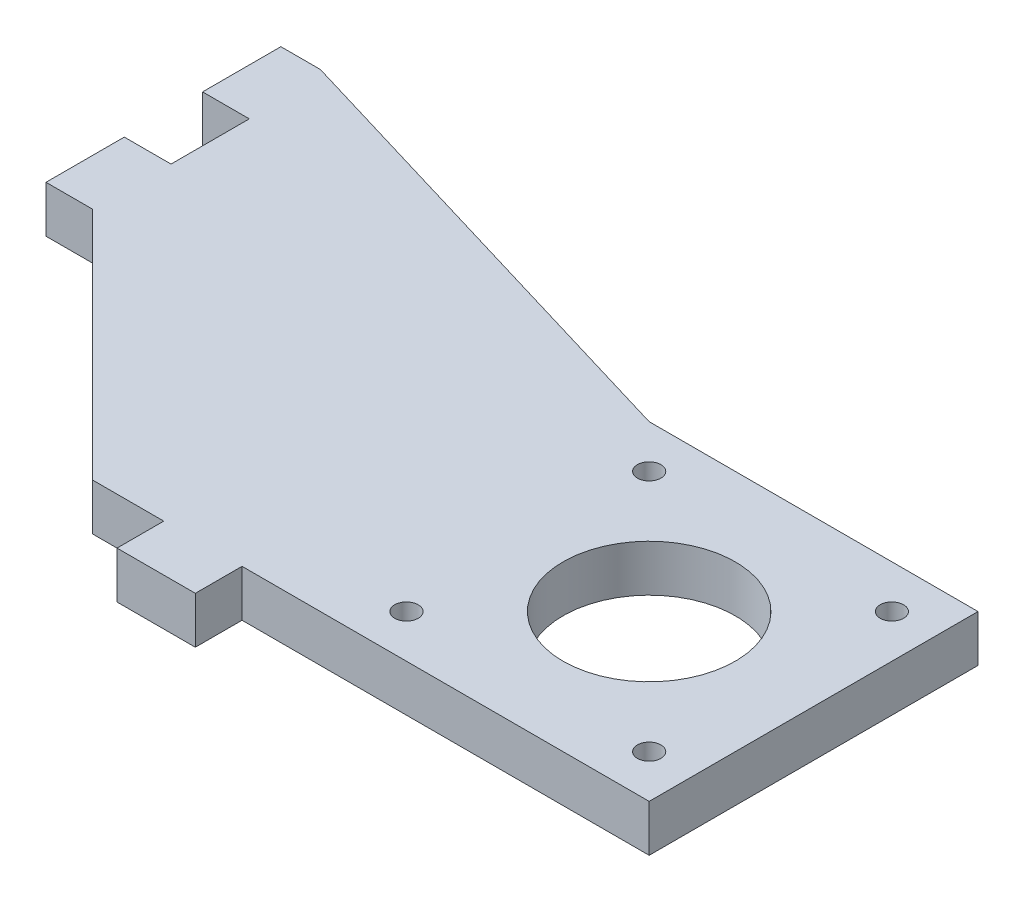
ISO-10303-21;
HEADER;
FILE_DESCRIPTION(('STEP AP214'),'2;1');
FILE_NAME('part.step','',(''),(''),'','','');
FILE_SCHEMA(('AUTOMOTIVE_DESIGN { 1 0 10303 214 1 1 1 1 }'));
ENDSEC;
DATA;
#1=APPLICATION_CONTEXT('core data for automotive mechanical design processes');
#2=APPLICATION_PROTOCOL_DEFINITION('international standard','automotive_design',2000,#1);
#3=PRODUCT_CONTEXT('',#1,'mechanical');
#4=PRODUCT('Part','Part','',(#3));
#5=PRODUCT_RELATED_PRODUCT_CATEGORY('part','',(#4));
#6=PRODUCT_DEFINITION_FORMATION('','',#4);
#7=PRODUCT_DEFINITION_CONTEXT('part definition',#1,'design');
#8=PRODUCT_DEFINITION('design','',#6,#7);
#9=PRODUCT_DEFINITION_SHAPE('','',#8);
#10=(LENGTH_UNIT() NAMED_UNIT(*) SI_UNIT(.MILLI.,.METRE.));
#11=(NAMED_UNIT(*) PLANE_ANGLE_UNIT() SI_UNIT($,.RADIAN.));
#12=(NAMED_UNIT(*) SI_UNIT($,.STERADIAN.) SOLID_ANGLE_UNIT());
#13=UNCERTAINTY_MEASURE_WITH_UNIT(LENGTH_MEASURE(1.E-05),#10,'distance_accuracy_value','');
#14=(GEOMETRIC_REPRESENTATION_CONTEXT(3) GLOBAL_UNCERTAINTY_ASSIGNED_CONTEXT((#13)) GLOBAL_UNIT_ASSIGNED_CONTEXT((#10,
#11,#12)) REPRESENTATION_CONTEXT('',''));
#15=CARTESIAN_POINT('',(0.,0.,0.));
#16=DIRECTION('',(0.,0.,1.));
#17=DIRECTION('',(1.,0.,0.));
#18=AXIS2_PLACEMENT_3D('',#15,#16,#17);
#19=CARTESIAN_POINT('',(29.9590399999999,5.969,29.95904));
#20=DIRECTION('',(0.707106781186549,0.,-0.707106781186546));
#21=DIRECTION('',(-0.707106781186546,0.,-0.707106781186549));
#22=AXIS2_PLACEMENT_3D('',#19,#20,#21);
#23=PLANE('',#22);
#24=DIRECTION('',(0.707106781186546,0.,0.707106781186549));
#25=VECTOR('',#24,1.);
#26=CARTESIAN_POINT('',(29.9590399999999,0.,29.95904));
#27=LINE('',#26,#25);
#28=CARTESIAN_POINT('',(0.,0.,0.));
#29=VERTEX_POINT('',#28);
#30=CARTESIAN_POINT('',(29.9590399999999,0.,29.95904));
#31=VERTEX_POINT('',#30);
#32=EDGE_CURVE('E160',#29,#31,#27,.T.);
#33=ORIENTED_EDGE('',*,*,#32,.T.);
#34=DIRECTION('',(0.,-1.,0.));
#35=VECTOR('',#34,1.);
#36=CARTESIAN_POINT('',(29.9590399999999,5.969,29.95904));
#37=LINE('',#36,#35);
#38=CARTESIAN_POINT('',(29.9590399999999,5.969,29.95904));
#39=VERTEX_POINT('',#38);
#40=EDGE_CURVE('E11',#39,#31,#37,.T.);
#41=ORIENTED_EDGE('',*,*,#40,.F.);
#42=DIRECTION('',(0.707106781186546,0.,0.707106781186549));
#43=VECTOR('',#42,1.);
#44=CARTESIAN_POINT('',(29.9590399999999,5.969,29.95904));
#45=LINE('',#44,#43);
#46=CARTESIAN_POINT('',(0.,5.969,0.));
#47=VERTEX_POINT('',#46);
#48=EDGE_CURVE('E186',#47,#39,#45,.T.);
#49=ORIENTED_EDGE('',*,*,#48,.F.);
#50=DIRECTION('',(0.,-1.,0.));
#51=VECTOR('',#50,1.);
#52=CARTESIAN_POINT('',(0.,5.969,0.));
#53=LINE('',#52,#51);
#54=EDGE_CURVE('E156',#47,#29,#53,.T.);
#55=ORIENTED_EDGE('',*,*,#54,.T.);
#56=EDGE_LOOP('',(#33,#41,#49,#55));
#57=FACE_BOUND('',#56,.T.);
#58=ADVANCED_FACE('F32',(#57),#23,.F.);
#59=CARTESIAN_POINT('',(39.031,5.969,29.95904));
#60=DIRECTION('',(0.,0.,-1.));
#61=DIRECTION('',(-1.,0.,0.));
#62=AXIS2_PLACEMENT_3D('',#59,#60,#61);
#63=PLANE('',#62);
#64=DIRECTION('',(1.,0.,0.));
#65=VECTOR('',#64,1.);
#66=CARTESIAN_POINT('',(39.031,0.,29.95904));
#67=LINE('',#66,#65);
#68=CARTESIAN_POINT('',(39.031,0.,29.95904));
#69=VERTEX_POINT('',#68);
#70=EDGE_CURVE('E163',#31,#69,#67,.T.);
#71=ORIENTED_EDGE('',*,*,#70,.T.);
#72=DIRECTION('',(0.,-1.,0.));
#73=VECTOR('',#72,1.);
#74=CARTESIAN_POINT('',(39.031,5.969,29.95904));
#75=LINE('',#74,#73);
#76=CARTESIAN_POINT('',(39.031,5.969,29.95904));
#77=VERTEX_POINT('',#76);
#78=EDGE_CURVE('E40',#77,#69,#75,.T.);
#79=ORIENTED_EDGE('',*,*,#78,.F.);
#80=DIRECTION('',(1.,0.,0.));
#81=VECTOR('',#80,1.);
#82=CARTESIAN_POINT('',(39.031,5.969,29.95904));
#83=LINE('',#82,#81);
#84=EDGE_CURVE('E104',#39,#77,#83,.T.);
#85=ORIENTED_EDGE('',*,*,#84,.F.);
#86=ORIENTED_EDGE('',*,*,#40,.T.);
#87=EDGE_LOOP('',(#71,#79,#85,#86));
#88=FACE_BOUND('',#87,.T.);
#89=ADVANCED_FACE('F271',(#88),#63,.F.);
#90=CARTESIAN_POINT('',(39.031,5.969,35.92804));
#91=DIRECTION('',(1.,0.,0.));
#92=DIRECTION('',(0.,0.,-1.));
#93=AXIS2_PLACEMENT_3D('',#90,#91,#92);
#94=PLANE('',#93);
#95=DIRECTION('',(0.,0.,1.));
#96=VECTOR('',#95,1.);
#97=CARTESIAN_POINT('',(39.031,0.,35.92804));
#98=LINE('',#97,#96);
#99=CARTESIAN_POINT('',(39.031,0.,35.92804));
#100=VERTEX_POINT('',#99);
#101=EDGE_CURVE('E166',#69,#100,#98,.T.);
#102=ORIENTED_EDGE('',*,*,#101,.T.);
#103=DIRECTION('',(0.,-1.,0.));
#104=VECTOR('',#103,1.);
#105=CARTESIAN_POINT('',(39.031,5.969,35.92804));
#106=LINE('',#105,#104);
#107=CARTESIAN_POINT('',(39.031,5.969,35.92804));
#108=VERTEX_POINT('',#107);
#109=EDGE_CURVE('E208',#108,#100,#106,.T.);
#110=ORIENTED_EDGE('',*,*,#109,.F.);
#111=DIRECTION('',(0.,0.,1.));
#112=VECTOR('',#111,1.);
#113=CARTESIAN_POINT('',(39.031,5.969,35.92804));
#114=LINE('',#113,#112);
#115=EDGE_CURVE('E216',#77,#108,#114,.T.);
#116=ORIENTED_EDGE('',*,*,#115,.F.);
#117=ORIENTED_EDGE('',*,*,#78,.T.);
#118=EDGE_LOOP('',(#102,#110,#116,#117));
#119=FACE_BOUND('',#118,.T.);
#120=ADVANCED_FACE('F214',(#119),#94,.F.);
#121=CARTESIAN_POINT('',(49.031,5.969,35.92804));
#122=DIRECTION('',(0.,0.,-1.));
#123=DIRECTION('',(-1.,0.,0.));
#124=AXIS2_PLACEMENT_3D('',#121,#122,#123);
#125=PLANE('',#124);
#126=DIRECTION('',(1.,0.,0.));
#127=VECTOR('',#126,1.);
#128=CARTESIAN_POINT('',(49.031,0.,35.92804));
#129=LINE('',#128,#127);
#130=CARTESIAN_POINT('',(49.031,0.,35.92804));
#131=VERTEX_POINT('',#130);
#132=EDGE_CURVE('E168',#100,#131,#129,.T.);
#133=ORIENTED_EDGE('',*,*,#132,.T.);
#134=DIRECTION('',(0.,-1.,0.));
#135=VECTOR('',#134,1.);
#136=CARTESIAN_POINT('',(49.031,5.969,35.92804));
#137=LINE('',#136,#135);
#138=CARTESIAN_POINT('',(49.031,5.969,35.92804));
#139=VERTEX_POINT('',#138);
#140=EDGE_CURVE('E205',#139,#131,#137,.T.);
#141=ORIENTED_EDGE('',*,*,#140,.F.);
#142=DIRECTION('',(1.,0.,0.));
#143=VECTOR('',#142,1.);
#144=CARTESIAN_POINT('',(49.031,5.969,35.92804));
#145=LINE('',#144,#143);
#146=EDGE_CURVE('E236',#108,#139,#145,.T.);
#147=ORIENTED_EDGE('',*,*,#146,.F.);
#148=ORIENTED_EDGE('',*,*,#109,.T.);
#149=EDGE_LOOP('',(#133,#141,#147,#148));
#150=FACE_BOUND('',#149,.T.);
#151=ADVANCED_FACE('F226',(#150),#125,.F.);
#152=CARTESIAN_POINT('',(49.031,5.969,29.95904));
#153=DIRECTION('',(-1.,0.,0.));
#154=DIRECTION('',(0.,0.,1.));
#155=AXIS2_PLACEMENT_3D('',#152,#153,#154);
#156=PLANE('',#155);
#157=DIRECTION('',(0.,0.,-1.));
#158=VECTOR('',#157,1.);
#159=CARTESIAN_POINT('',(49.031,0.,29.95904));
#160=LINE('',#159,#158);
#161=CARTESIAN_POINT('',(49.031,0.,29.95904));
#162=VERTEX_POINT('',#161);
#163=EDGE_CURVE('E170',#131,#162,#160,.T.);
#164=ORIENTED_EDGE('',*,*,#163,.T.);
#165=DIRECTION('',(0.,-1.,0.));
#166=VECTOR('',#165,1.);
#167=CARTESIAN_POINT('',(49.031,5.969,29.95904));
#168=LINE('',#167,#166);
#169=CARTESIAN_POINT('',(49.031,5.969,29.95904));
#170=VERTEX_POINT('',#169);
#171=EDGE_CURVE('E202',#170,#162,#168,.T.);
#172=ORIENTED_EDGE('',*,*,#171,.F.);
#173=DIRECTION('',(0.,0.,-1.));
#174=VECTOR('',#173,1.);
#175=CARTESIAN_POINT('',(49.031,5.969,29.95904));
#176=LINE('',#175,#174);
#177=EDGE_CURVE('E232',#139,#170,#176,.T.);
#178=ORIENTED_EDGE('',*,*,#177,.F.);
#179=ORIENTED_EDGE('',*,*,#140,.T.);
#180=EDGE_LOOP('',(#164,#172,#178,#179));
#181=FACE_BOUND('',#180,.T.);
#182=ADVANCED_FACE('F230',(#181),#156,.F.);
#183=CARTESIAN_POINT('',(59.031,5.969,29.95904));
#184=DIRECTION('',(0.,0.,-1.));
#185=DIRECTION('',(-1.,0.,0.));
#186=AXIS2_PLACEMENT_3D('',#183,#184,#185);
#187=PLANE('',#186);
#188=DIRECTION('',(1.,0.,0.));
#189=VECTOR('',#188,1.);
#190=CARTESIAN_POINT('',(59.031,0.,29.95904));
#191=LINE('',#190,#189);
#192=CARTESIAN_POINT('',(101.031,0.,29.95904));
#193=VERTEX_POINT('',#192);
#194=EDGE_CURVE('E172',#162,#193,#191,.T.);
#195=ORIENTED_EDGE('',*,*,#194,.T.);
#196=DIRECTION('',(0.,1.,0.));
#197=VECTOR('',#196,1.);
#198=CARTESIAN_POINT('',(101.031,0.,29.95904));
#199=LINE('',#198,#197);
#200=CARTESIAN_POINT('',(101.031,5.969,29.95904));
#201=VERTEX_POINT('',#200);
#202=EDGE_CURVE('E471',#193,#201,#199,.T.);
#203=ORIENTED_EDGE('',*,*,#202,.T.);
#204=DIRECTION('',(1.,0.,0.));
#205=VECTOR('',#204,1.);
#206=CARTESIAN_POINT('',(59.031,5.969,29.95904));
#207=LINE('',#206,#205);
#208=EDGE_CURVE('E235',#170,#201,#207,.T.);
#209=ORIENTED_EDGE('',*,*,#208,.F.);
#210=ORIENTED_EDGE('',*,*,#171,.T.);
#211=EDGE_LOOP('',(#195,#203,#209,#210));
#212=FACE_BOUND('',#211,.T.);
#213=ADVANCED_FACE('F284',(#212),#187,.F.);
#214=CARTESIAN_POINT('',(-5.969,5.969,-30.));
#215=DIRECTION('',(0.,0.,1.));
#216=DIRECTION('',(1.,0.,0.));
#217=AXIS2_PLACEMENT_3D('',#214,#215,#216);
#218=PLANE('',#217);
#219=DIRECTION('',(-1.,0.,0.));
#220=VECTOR('',#219,1.);
#221=CARTESIAN_POINT('',(-5.969,0.,-30.));
#222=LINE('',#221,#220);
#223=CARTESIAN_POINT('',(-0.928039999999804,0.,-30.));
#224=VERTEX_POINT('',#223);
#225=CARTESIAN_POINT('',(-5.969,0.,-30.));
#226=VERTEX_POINT('',#225);
#227=EDGE_CURVE('E175',#224,#226,#222,.T.);
#228=ORIENTED_EDGE('',*,*,#227,.T.);
#229=DIRECTION('',(0.,-1.,0.));
#230=VECTOR('',#229,1.);
#231=CARTESIAN_POINT('',(-5.969,5.969,-30.));
#232=LINE('',#231,#230);
#233=CARTESIAN_POINT('',(-5.969,5.969,-30.));
#234=VERTEX_POINT('',#233);
#235=EDGE_CURVE('E196',#234,#226,#232,.T.);
#236=ORIENTED_EDGE('',*,*,#235,.F.);
#237=DIRECTION('',(-1.,0.,0.));
#238=VECTOR('',#237,1.);
#239=CARTESIAN_POINT('',(-5.969,5.969,-30.));
#240=LINE('',#239,#238);
#241=CARTESIAN_POINT('',(-0.928039999999804,5.969,-30.));
#242=VERTEX_POINT('',#241);
#243=EDGE_CURVE('E238',#242,#234,#240,.T.);
#244=ORIENTED_EDGE('',*,*,#243,.F.);
#245=DIRECTION('',(0.,-1.,0.));
#246=VECTOR('',#245,1.);
#247=CARTESIAN_POINT('',(-0.928039999999804,5.969,-30.));
#248=LINE('',#247,#246);
#249=EDGE_CURVE('E199',#242,#224,#248,.T.);
#250=ORIENTED_EDGE('',*,*,#249,.T.);
#251=EDGE_LOOP('',(#228,#236,#244,#250));
#252=FACE_BOUND('',#251,.T.);
#253=ADVANCED_FACE('F287',(#252),#218,.F.);
#254=CARTESIAN_POINT('',(-5.969,5.969,-20.));
#255=DIRECTION('',(1.,0.,0.));
#256=DIRECTION('',(0.,0.,-1.));
#257=AXIS2_PLACEMENT_3D('',#254,#255,#256);
#258=PLANE('',#257);
#259=DIRECTION('',(0.,0.,1.));
#260=VECTOR('',#259,1.);
#261=CARTESIAN_POINT('',(-5.969,0.,-20.));
#262=LINE('',#261,#260);
#263=CARTESIAN_POINT('',(-5.969,0.,-20.));
#264=VERTEX_POINT('',#263);
#265=EDGE_CURVE('E177',#226,#264,#262,.T.);
#266=ORIENTED_EDGE('',*,*,#265,.T.);
#267=DIRECTION('',(0.,-1.,0.));
#268=VECTOR('',#267,1.);
#269=CARTESIAN_POINT('',(-5.969,5.969,-20.));
#270=LINE('',#269,#268);
#271=CARTESIAN_POINT('',(-5.969,5.969,-20.));
#272=VERTEX_POINT('',#271);
#273=EDGE_CURVE('E193',#272,#264,#270,.T.);
#274=ORIENTED_EDGE('',*,*,#273,.F.);
#275=DIRECTION('',(0.,0.,1.));
#276=VECTOR('',#275,1.);
#277=CARTESIAN_POINT('',(-5.969,5.969,-20.));
#278=LINE('',#277,#276);
#279=EDGE_CURVE('E244',#234,#272,#278,.T.);
#280=ORIENTED_EDGE('',*,*,#279,.F.);
#281=ORIENTED_EDGE('',*,*,#235,.T.);
#282=EDGE_LOOP('',(#266,#274,#280,#281));
#283=FACE_BOUND('',#282,.T.);
#284=ADVANCED_FACE('F291',(#283),#258,.F.);
#285=CARTESIAN_POINT('',(0.,5.969,-20.));
#286=DIRECTION('',(0.,0.,-1.));
#287=DIRECTION('',(-1.,0.,0.));
#288=AXIS2_PLACEMENT_3D('',#285,#286,#287);
#289=PLANE('',#288);
#290=DIRECTION('',(1.,0.,0.));
#291=VECTOR('',#290,1.);
#292=CARTESIAN_POINT('',(0.,0.,-20.));
#293=LINE('',#292,#291);
#294=CARTESIAN_POINT('',(0.,0.,-20.));
#295=VERTEX_POINT('',#294);
#296=EDGE_CURVE('E179',#264,#295,#293,.T.);
#297=ORIENTED_EDGE('',*,*,#296,.T.);
#298=DIRECTION('',(0.,-1.,0.));
#299=VECTOR('',#298,1.);
#300=CARTESIAN_POINT('',(0.,5.969,-20.));
#301=LINE('',#300,#299);
#302=CARTESIAN_POINT('',(0.,5.969,-20.));
#303=VERTEX_POINT('',#302);
#304=EDGE_CURVE('E190',#303,#295,#301,.T.);
#305=ORIENTED_EDGE('',*,*,#304,.F.);
#306=DIRECTION('',(1.,0.,0.));
#307=VECTOR('',#306,1.);
#308=CARTESIAN_POINT('',(0.,5.969,-20.));
#309=LINE('',#308,#307);
#310=EDGE_CURVE('E246',#272,#303,#309,.T.);
#311=ORIENTED_EDGE('',*,*,#310,.F.);
#312=ORIENTED_EDGE('',*,*,#273,.T.);
#313=EDGE_LOOP('',(#297,#305,#311,#312));
#314=FACE_BOUND('',#313,.T.);
#315=ADVANCED_FACE('F252',(#314),#289,.F.);
#316=CARTESIAN_POINT('',(0.,5.969,-10.));
#317=DIRECTION('',(1.,0.,0.));
#318=DIRECTION('',(0.,0.,-1.));
#319=AXIS2_PLACEMENT_3D('',#316,#317,#318);
#320=PLANE('',#319);
#321=DIRECTION('',(0.,0.,1.));
#322=VECTOR('',#321,1.);
#323=CARTESIAN_POINT('',(0.,0.,-10.));
#324=LINE('',#323,#322);
#325=CARTESIAN_POINT('',(0.,0.,-10.));
#326=VERTEX_POINT('',#325);
#327=EDGE_CURVE('E181',#295,#326,#324,.T.);
#328=ORIENTED_EDGE('',*,*,#327,.T.);
#329=DIRECTION('',(0.,-1.,0.));
#330=VECTOR('',#329,1.);
#331=CARTESIAN_POINT('',(0.,5.969,-10.));
#332=LINE('',#331,#330);
#333=CARTESIAN_POINT('',(0.,5.969,-10.));
#334=VERTEX_POINT('',#333);
#335=EDGE_CURVE('E151',#334,#326,#332,.T.);
#336=ORIENTED_EDGE('',*,*,#335,.F.);
#337=DIRECTION('',(0.,0.,1.));
#338=VECTOR('',#337,1.);
#339=CARTESIAN_POINT('',(0.,5.969,-10.));
#340=LINE('',#339,#338);
#341=EDGE_CURVE('E142',#303,#334,#340,.T.);
#342=ORIENTED_EDGE('',*,*,#341,.F.);
#343=ORIENTED_EDGE('',*,*,#304,.T.);
#344=EDGE_LOOP('',(#328,#336,#342,#343));
#345=FACE_BOUND('',#344,.T.);
#346=ADVANCED_FACE('F256',(#345),#320,.F.);
#347=CARTESIAN_POINT('',(-5.969,5.969,-10.));
#348=DIRECTION('',(0.,0.,1.));
#349=DIRECTION('',(1.,0.,0.));
#350=AXIS2_PLACEMENT_3D('',#347,#348,#349);
#351=PLANE('',#350);
#352=DIRECTION('',(-1.,0.,0.));
#353=VECTOR('',#352,1.);
#354=CARTESIAN_POINT('',(-5.969,0.,-10.));
#355=LINE('',#354,#353);
#356=CARTESIAN_POINT('',(-5.969,0.,-10.));
#357=VERTEX_POINT('',#356);
#358=EDGE_CURVE('E150',#326,#357,#355,.T.);
#359=ORIENTED_EDGE('',*,*,#358,.T.);
#360=DIRECTION('',(0.,-1.,0.));
#361=VECTOR('',#360,1.);
#362=CARTESIAN_POINT('',(-5.969,5.969,-10.));
#363=LINE('',#362,#361);
#364=CARTESIAN_POINT('',(-5.969,5.969,-10.));
#365=VERTEX_POINT('',#364);
#366=EDGE_CURVE('E147',#365,#357,#363,.T.);
#367=ORIENTED_EDGE('',*,*,#366,.F.);
#368=DIRECTION('',(-1.,0.,0.));
#369=VECTOR('',#368,1.);
#370=CARTESIAN_POINT('',(-5.969,5.969,-10.));
#371=LINE('',#370,#369);
#372=EDGE_CURVE('E135',#334,#365,#371,.T.);
#373=ORIENTED_EDGE('',*,*,#372,.F.);
#374=ORIENTED_EDGE('',*,*,#335,.T.);
#375=EDGE_LOOP('',(#359,#367,#373,#374));
#376=FACE_BOUND('',#375,.T.);
#377=ADVANCED_FACE('F148',(#376),#351,.F.);
#378=CARTESIAN_POINT('',(-5.969,5.969,0.));
#379=DIRECTION('',(1.,0.,0.));
#380=DIRECTION('',(0.,0.,-1.));
#381=AXIS2_PLACEMENT_3D('',#378,#379,#380);
#382=PLANE('',#381);
#383=DIRECTION('',(0.,0.,1.));
#384=VECTOR('',#383,1.);
#385=CARTESIAN_POINT('',(-5.969,0.,0.));
#386=LINE('',#385,#384);
#387=CARTESIAN_POINT('',(-5.969,0.,0.));
#388=VERTEX_POINT('',#387);
#389=EDGE_CURVE('E90',#357,#388,#386,.T.);
#390=ORIENTED_EDGE('',*,*,#389,.T.);
#391=DIRECTION('',(0.,-1.,0.));
#392=VECTOR('',#391,1.);
#393=CARTESIAN_POINT('',(-5.969,5.969,0.));
#394=LINE('',#393,#392);
#395=CARTESIAN_POINT('',(-5.969,5.969,0.));
#396=VERTEX_POINT('',#395);
#397=EDGE_CURVE('E152',#396,#388,#394,.T.);
#398=ORIENTED_EDGE('',*,*,#397,.F.);
#399=DIRECTION('',(0.,0.,1.));
#400=VECTOR('',#399,1.);
#401=CARTESIAN_POINT('',(-5.969,5.969,0.));
#402=LINE('',#401,#400);
#403=EDGE_CURVE('E140',#365,#396,#402,.T.);
#404=ORIENTED_EDGE('',*,*,#403,.F.);
#405=ORIENTED_EDGE('',*,*,#366,.T.);
#406=EDGE_LOOP('',(#390,#398,#404,#405));
#407=FACE_BOUND('',#406,.T.);
#408=ADVANCED_FACE('F154',(#407),#382,.F.);
#409=CARTESIAN_POINT('',(0.,5.969,0.));
#410=DIRECTION('',(0.,0.,-1.));
#411=DIRECTION('',(-1.,0.,0.));
#412=AXIS2_PLACEMENT_3D('',#409,#410,#411);
#413=PLANE('',#412);
#414=DIRECTION('',(1.,0.,0.));
#415=VECTOR('',#414,1.);
#416=CARTESIAN_POINT('',(0.,0.,0.));
#417=LINE('',#416,#415);
#418=EDGE_CURVE('E96',#388,#29,#417,.T.);
#419=ORIENTED_EDGE('',*,*,#418,.T.);
#420=ORIENTED_EDGE('',*,*,#54,.F.);
#421=DIRECTION('',(1.,0.,0.));
#422=VECTOR('',#421,1.);
#423=CARTESIAN_POINT('',(0.,5.969,0.));
#424=LINE('',#423,#422);
#425=EDGE_CURVE('E48',#396,#47,#424,.T.);
#426=ORIENTED_EDGE('',*,*,#425,.F.);
#427=ORIENTED_EDGE('',*,*,#397,.T.);
#428=EDGE_LOOP('',(#419,#420,#426,#427));
#429=FACE_BOUND('',#428,.T.);
#430=ADVANCED_FACE('F260',(#429),#413,.F.);
#431=CARTESIAN_POINT('',(0.,5.969,0.));
#432=DIRECTION('',(0.,1.,0.));
#433=DIRECTION('',(0.,0.,1.));
#434=AXIS2_PLACEMENT_3D('',#431,#432,#433);
#435=PLANE('',#434);
#436=ORIENTED_EDGE('',*,*,#48,.T.);
#437=ORIENTED_EDGE('',*,*,#84,.T.);
#438=ORIENTED_EDGE('',*,*,#115,.T.);
#439=ORIENTED_EDGE('',*,*,#146,.T.);
#440=ORIENTED_EDGE('',*,*,#177,.T.);
#441=ORIENTED_EDGE('',*,*,#208,.T.);
#442=DIRECTION('',(0.,0.,-1.));
#443=VECTOR('',#442,1.);
#444=CARTESIAN_POINT('',(101.031,5.969,29.95904));
#445=LINE('',#444,#443);
#446=CARTESIAN_POINT('',(101.031,5.969,-12.04096));
#447=VERTEX_POINT('',#446);
#448=EDGE_CURVE('E458',#201,#447,#445,.T.);
#449=ORIENTED_EDGE('',*,*,#448,.T.);
#450=DIRECTION('',(-1.,0.,0.));
#451=VECTOR('',#450,1.);
#452=CARTESIAN_POINT('',(59.031,5.969,-12.04096));
#453=LINE('',#452,#451);
#454=CARTESIAN_POINT('',(59.031,5.969,-12.04096));
#455=VERTEX_POINT('',#454);
#456=EDGE_CURVE('E474',#447,#455,#453,.T.);
#457=ORIENTED_EDGE('',*,*,#456,.T.);
#458=DIRECTION('',(-0.957952271787374,0.,-0.286927595357103));
#459=VECTOR('',#458,1.);
#460=CARTESIAN_POINT('',(59.031,5.969,-12.04096));
#461=LINE('',#460,#459);
#462=EDGE_CURVE('E465',#455,#242,#461,.T.);
#463=ORIENTED_EDGE('',*,*,#462,.T.);
#464=ORIENTED_EDGE('',*,*,#243,.T.);
#465=ORIENTED_EDGE('',*,*,#279,.T.);
#466=ORIENTED_EDGE('',*,*,#310,.T.);
#467=ORIENTED_EDGE('',*,*,#341,.T.);
#468=ORIENTED_EDGE('',*,*,#372,.T.);
#469=ORIENTED_EDGE('',*,*,#403,.T.);
#470=ORIENTED_EDGE('',*,*,#425,.T.);
#471=EDGE_LOOP('',(#436,#437,#438,#439,#440,#441,#449,#457,#463,#464,#465,#466,#467,#468,#469,#470));
#472=FACE_BOUND('',#471,.T.);
#473=CARTESIAN_POINT('',(95.531,5.969,24.45904));
#474=DIRECTION('',(0.,1.,0.));
#475=DIRECTION('',(0.,0.,1.));
#476=AXIS2_PLACEMENT_3D('',#473,#474,#475);
#477=CIRCLE('',#476,1.5);
#478=CARTESIAN_POINT('',(95.531,5.969,25.95904));
#479=VERTEX_POINT('',#478);
#480=EDGE_CURVE('E432',#479,#479,#477,.T.);
#481=ORIENTED_EDGE('',*,*,#480,.F.);
#482=EDGE_LOOP('',(#481));
#483=FACE_BOUND('',#482,.T.);
#484=CARTESIAN_POINT('',(64.531,5.969,24.45904));
#485=DIRECTION('',(0.,1.,0.));
#486=DIRECTION('',(0.,0.,1.));
#487=AXIS2_PLACEMENT_3D('',#484,#485,#486);
#488=CIRCLE('',#487,1.5);
#489=CARTESIAN_POINT('',(64.531,5.969,25.95904));
#490=VERTEX_POINT('',#489);
#491=EDGE_CURVE('E434',#490,#490,#488,.T.);
#492=ORIENTED_EDGE('',*,*,#491,.F.);
#493=EDGE_LOOP('',(#492));
#494=FACE_BOUND('',#493,.T.);
#495=CARTESIAN_POINT('',(95.531,5.969,-6.54096000000002));
#496=DIRECTION('',(0.,1.,0.));
#497=DIRECTION('',(0.,0.,1.));
#498=AXIS2_PLACEMENT_3D('',#495,#496,#497);
#499=CIRCLE('',#498,1.5);
#500=CARTESIAN_POINT('',(95.531,5.969,-5.04096000000002));
#501=VERTEX_POINT('',#500);
#502=EDGE_CURVE('E440',#501,#501,#499,.T.);
#503=ORIENTED_EDGE('',*,*,#502,.F.);
#504=EDGE_LOOP('',(#503));
#505=FACE_BOUND('',#504,.T.);
#506=CARTESIAN_POINT('',(64.531,5.969,-6.54096000000002));
#507=DIRECTION('',(0.,1.,0.));
#508=DIRECTION('',(0.,0.,1.));
#509=AXIS2_PLACEMENT_3D('',#506,#507,#508);
#510=CIRCLE('',#509,1.5);
#511=CARTESIAN_POINT('',(64.531,5.969,-5.04096000000002));
#512=VERTEX_POINT('',#511);
#513=EDGE_CURVE('E446',#512,#512,#510,.T.);
#514=ORIENTED_EDGE('',*,*,#513,.F.);
#515=EDGE_LOOP('',(#514));
#516=FACE_BOUND('',#515,.T.);
#517=CARTESIAN_POINT('',(80.031,5.969,8.95903999999999));
#518=DIRECTION('',(0.,1.,0.));
#519=DIRECTION('',(0.,0.,1.));
#520=AXIS2_PLACEMENT_3D('',#517,#518,#519);
#521=CIRCLE('',#520,11.);
#522=CARTESIAN_POINT('',(80.031,5.969,19.95904));
#523=VERTEX_POINT('',#522);
#524=EDGE_CURVE('E452',#523,#523,#521,.T.);
#525=ORIENTED_EDGE('',*,*,#524,.F.);
#526=EDGE_LOOP('',(#525));
#527=FACE_BOUND('',#526,.T.);
#528=ADVANCED_FACE('F137',(#472,#483,#494,#505,#516,#527),#435,.T.);
#529=CARTESIAN_POINT('',(0.,0.,0.));
#530=DIRECTION('',(0.,1.,0.));
#531=DIRECTION('',(0.,0.,1.));
#532=AXIS2_PLACEMENT_3D('',#529,#530,#531);
#533=PLANE('',#532);
#534=ORIENTED_EDGE('',*,*,#32,.F.);
#535=ORIENTED_EDGE('',*,*,#418,.F.);
#536=ORIENTED_EDGE('',*,*,#389,.F.);
#537=ORIENTED_EDGE('',*,*,#358,.F.);
#538=ORIENTED_EDGE('',*,*,#327,.F.);
#539=ORIENTED_EDGE('',*,*,#296,.F.);
#540=ORIENTED_EDGE('',*,*,#265,.F.);
#541=ORIENTED_EDGE('',*,*,#227,.F.);
#542=DIRECTION('',(-0.957952271787374,0.,-0.286927595357103));
#543=VECTOR('',#542,1.);
#544=CARTESIAN_POINT('',(59.031,0.,-12.04096));
#545=LINE('',#544,#543);
#546=CARTESIAN_POINT('',(59.031,0.,-12.04096));
#547=VERTEX_POINT('',#546);
#548=EDGE_CURVE('E468',#547,#224,#545,.T.);
#549=ORIENTED_EDGE('',*,*,#548,.F.);
#550=DIRECTION('',(-1.,0.,0.));
#551=VECTOR('',#550,1.);
#552=CARTESIAN_POINT('',(59.031,0.,-12.04096));
#553=LINE('',#552,#551);
#554=CARTESIAN_POINT('',(101.031,0.,-12.04096));
#555=VERTEX_POINT('',#554);
#556=EDGE_CURVE('E464',#555,#547,#553,.T.);
#557=ORIENTED_EDGE('',*,*,#556,.F.);
#558=DIRECTION('',(0.,0.,-1.));
#559=VECTOR('',#558,1.);
#560=CARTESIAN_POINT('',(101.031,0.,29.95904));
#561=LINE('',#560,#559);
#562=EDGE_CURVE('E461',#193,#555,#561,.T.);
#563=ORIENTED_EDGE('',*,*,#562,.F.);
#564=ORIENTED_EDGE('',*,*,#194,.F.);
#565=ORIENTED_EDGE('',*,*,#163,.F.);
#566=ORIENTED_EDGE('',*,*,#132,.F.);
#567=ORIENTED_EDGE('',*,*,#101,.F.);
#568=ORIENTED_EDGE('',*,*,#70,.F.);
#569=EDGE_LOOP('',(#534,#535,#536,#537,#538,#539,#540,#541,#549,#557,#563,#564,#565,#566,#567,#568));
#570=FACE_BOUND('',#569,.T.);
#571=CARTESIAN_POINT('',(95.531,0.,24.45904));
#572=DIRECTION('',(0.,1.,0.));
#573=DIRECTION('',(0.,0.,1.));
#574=AXIS2_PLACEMENT_3D('',#571,#572,#573);
#575=CIRCLE('',#574,1.5);
#576=CARTESIAN_POINT('',(95.531,0.,25.95904));
#577=VERTEX_POINT('',#576);
#578=EDGE_CURVE('E429',#577,#577,#575,.T.);
#579=ORIENTED_EDGE('',*,*,#578,.T.);
#580=EDGE_LOOP('',(#579));
#581=FACE_BOUND('',#580,.T.);
#582=CARTESIAN_POINT('',(64.531,0.,24.45904));
#583=DIRECTION('',(0.,1.,0.));
#584=DIRECTION('',(0.,0.,1.));
#585=AXIS2_PLACEMENT_3D('',#582,#583,#584);
#586=CIRCLE('',#585,1.5);
#587=CARTESIAN_POINT('',(64.531,0.,25.95904));
#588=VERTEX_POINT('',#587);
#589=EDGE_CURVE('E437',#588,#588,#586,.T.);
#590=ORIENTED_EDGE('',*,*,#589,.T.);
#591=EDGE_LOOP('',(#590));
#592=FACE_BOUND('',#591,.T.);
#593=CARTESIAN_POINT('',(95.531,0.,-6.54096000000002));
#594=DIRECTION('',(0.,1.,0.));
#595=DIRECTION('',(0.,0.,1.));
#596=AXIS2_PLACEMENT_3D('',#593,#594,#595);
#597=CIRCLE('',#596,1.5);
#598=CARTESIAN_POINT('',(95.531,0.,-5.04096000000002));
#599=VERTEX_POINT('',#598);
#600=EDGE_CURVE('E443',#599,#599,#597,.T.);
#601=ORIENTED_EDGE('',*,*,#600,.T.);
#602=EDGE_LOOP('',(#601));
#603=FACE_BOUND('',#602,.T.);
#604=CARTESIAN_POINT('',(64.531,0.,-6.54096000000002));
#605=DIRECTION('',(0.,1.,0.));
#606=DIRECTION('',(0.,0.,1.));
#607=AXIS2_PLACEMENT_3D('',#604,#605,#606);
#608=CIRCLE('',#607,1.5);
#609=CARTESIAN_POINT('',(64.531,0.,-5.04096000000002));
#610=VERTEX_POINT('',#609);
#611=EDGE_CURVE('E449',#610,#610,#608,.T.);
#612=ORIENTED_EDGE('',*,*,#611,.T.);
#613=EDGE_LOOP('',(#612));
#614=FACE_BOUND('',#613,.T.);
#615=CARTESIAN_POINT('',(80.031,0.,8.95903999999999));
#616=DIRECTION('',(0.,1.,0.));
#617=DIRECTION('',(0.,0.,1.));
#618=AXIS2_PLACEMENT_3D('',#615,#616,#617);
#619=CIRCLE('',#618,11.);
#620=CARTESIAN_POINT('',(80.031,0.,19.95904));
#621=VERTEX_POINT('',#620);
#622=EDGE_CURVE('E455',#621,#621,#619,.T.);
#623=ORIENTED_EDGE('',*,*,#622,.T.);
#624=EDGE_LOOP('',(#623));
#625=FACE_BOUND('',#624,.T.);
#626=ADVANCED_FACE('F220',(#570,#581,#592,#603,#614,#625),#533,.F.);
#627=CARTESIAN_POINT('',(59.031,0.,-12.04096));
#628=DIRECTION('',(0.286927595357103,0.,-0.957952271787374));
#629=DIRECTION('',(-0.957952271787374,0.,-0.286927595357103));
#630=AXIS2_PLACEMENT_3D('',#627,#628,#629);
#631=PLANE('',#630);
#632=ORIENTED_EDGE('',*,*,#462,.F.);
#633=DIRECTION('',(0.,1.,0.));
#634=VECTOR('',#633,1.);
#635=CARTESIAN_POINT('',(59.031,0.,-12.04096));
#636=LINE('',#635,#634);
#637=EDGE_CURVE('E164',#547,#455,#636,.T.);
#638=ORIENTED_EDGE('',*,*,#637,.F.);
#639=ORIENTED_EDGE('',*,*,#548,.T.);
#640=ORIENTED_EDGE('',*,*,#249,.F.);
#641=EDGE_LOOP('',(#632,#638,#639,#640));
#642=FACE_BOUND('',#641,.T.);
#643=ADVANCED_FACE('F344',(#642),#631,.T.);
#644=CARTESIAN_POINT('',(59.031,0.,-12.04096));
#645=DIRECTION('',(0.,0.,-1.));
#646=DIRECTION('',(-1.,0.,0.));
#647=AXIS2_PLACEMENT_3D('',#644,#645,#646);
#648=PLANE('',#647);
#649=ORIENTED_EDGE('',*,*,#456,.F.);
#650=DIRECTION('',(0.,1.,0.));
#651=VECTOR('',#650,1.);
#652=CARTESIAN_POINT('',(101.031,0.,-12.04096));
#653=LINE('',#652,#651);
#654=EDGE_CURVE('E481',#555,#447,#653,.T.);
#655=ORIENTED_EDGE('',*,*,#654,.F.);
#656=ORIENTED_EDGE('',*,*,#556,.T.);
#657=ORIENTED_EDGE('',*,*,#637,.T.);
#658=EDGE_LOOP('',(#649,#655,#656,#657));
#659=FACE_BOUND('',#658,.T.);
#660=ADVANCED_FACE('F352',(#659),#648,.T.);
#661=CARTESIAN_POINT('',(101.031,0.,29.95904));
#662=DIRECTION('',(1.,0.,0.));
#663=DIRECTION('',(0.,0.,-1.));
#664=AXIS2_PLACEMENT_3D('',#661,#662,#663);
#665=PLANE('',#664);
#666=ORIENTED_EDGE('',*,*,#448,.F.);
#667=ORIENTED_EDGE('',*,*,#202,.F.);
#668=ORIENTED_EDGE('',*,*,#562,.T.);
#669=ORIENTED_EDGE('',*,*,#654,.T.);
#670=EDGE_LOOP('',(#666,#667,#668,#669));
#671=FACE_BOUND('',#670,.T.);
#672=ADVANCED_FACE('F362',(#671),#665,.T.);
#673=CARTESIAN_POINT('',(80.031,0.,8.95903999999999));
#674=DIRECTION('',(0.,1.,0.));
#675=DIRECTION('',(0.,0.,1.));
#676=AXIS2_PLACEMENT_3D('',#673,#674,#675);
#677=CYLINDRICAL_SURFACE('',#676,11.);
#678=ORIENTED_EDGE('',*,*,#622,.F.);
#679=EDGE_LOOP('',(#678));
#680=FACE_BOUND('',#679,.T.);
#681=ORIENTED_EDGE('',*,*,#524,.T.);
#682=EDGE_LOOP('',(#681));
#683=FACE_BOUND('',#682,.T.);
#684=ADVANCED_FACE('F372',(#680,#683),#677,.F.);
#685=CARTESIAN_POINT('',(64.531,0.,-6.54096000000002));
#686=DIRECTION('',(0.,1.,0.));
#687=DIRECTION('',(0.,0.,1.));
#688=AXIS2_PLACEMENT_3D('',#685,#686,#687);
#689=CYLINDRICAL_SURFACE('',#688,1.5);
#690=ORIENTED_EDGE('',*,*,#611,.F.);
#691=EDGE_LOOP('',(#690));
#692=FACE_BOUND('',#691,.T.);
#693=ORIENTED_EDGE('',*,*,#513,.T.);
#694=EDGE_LOOP('',(#693));
#695=FACE_BOUND('',#694,.T.);
#696=ADVANCED_FACE('F382',(#692,#695),#689,.F.);
#697=CARTESIAN_POINT('',(95.531,0.,-6.54096000000002));
#698=DIRECTION('',(0.,1.,0.));
#699=DIRECTION('',(0.,0.,1.));
#700=AXIS2_PLACEMENT_3D('',#697,#698,#699);
#701=CYLINDRICAL_SURFACE('',#700,1.5);
#702=ORIENTED_EDGE('',*,*,#600,.F.);
#703=EDGE_LOOP('',(#702));
#704=FACE_BOUND('',#703,.T.);
#705=ORIENTED_EDGE('',*,*,#502,.T.);
#706=EDGE_LOOP('',(#705));
#707=FACE_BOUND('',#706,.T.);
#708=ADVANCED_FACE('F392',(#704,#707),#701,.F.);
#709=CARTESIAN_POINT('',(64.531,0.,24.45904));
#710=DIRECTION('',(0.,1.,0.));
#711=DIRECTION('',(0.,0.,1.));
#712=AXIS2_PLACEMENT_3D('',#709,#710,#711);
#713=CYLINDRICAL_SURFACE('',#712,1.5);
#714=ORIENTED_EDGE('',*,*,#589,.F.);
#715=EDGE_LOOP('',(#714));
#716=FACE_BOUND('',#715,.T.);
#717=ORIENTED_EDGE('',*,*,#491,.T.);
#718=EDGE_LOOP('',(#717));
#719=FACE_BOUND('',#718,.T.);
#720=ADVANCED_FACE('F402',(#716,#719),#713,.F.);
#721=CARTESIAN_POINT('',(95.531,0.,24.45904));
#722=DIRECTION('',(0.,1.,0.));
#723=DIRECTION('',(0.,0.,1.));
#724=AXIS2_PLACEMENT_3D('',#721,#722,#723);
#725=CYLINDRICAL_SURFACE('',#724,1.5);
#726=ORIENTED_EDGE('',*,*,#578,.F.);
#727=EDGE_LOOP('',(#726));
#728=FACE_BOUND('',#727,.T.);
#729=ORIENTED_EDGE('',*,*,#480,.T.);
#730=EDGE_LOOP('',(#729));
#731=FACE_BOUND('',#730,.T.);
#732=ADVANCED_FACE('F412',(#728,#731),#725,.F.);
#733=CLOSED_SHELL('',(#58,#89,#120,#151,#182,#213,#253,#284,#315,#346,#377,#408,#430,#528,#626,
#643,#660,#672,#684,#696,#708,#720,#732));
#734=MANIFOLD_SOLID_BREP('B2',#733);
#735=ADVANCED_BREP_SHAPE_REPRESENTATION('',(#18,#734),#14);
#736=SHAPE_DEFINITION_REPRESENTATION(#9,#735);
ENDSEC;
END-ISO-10303-21;
